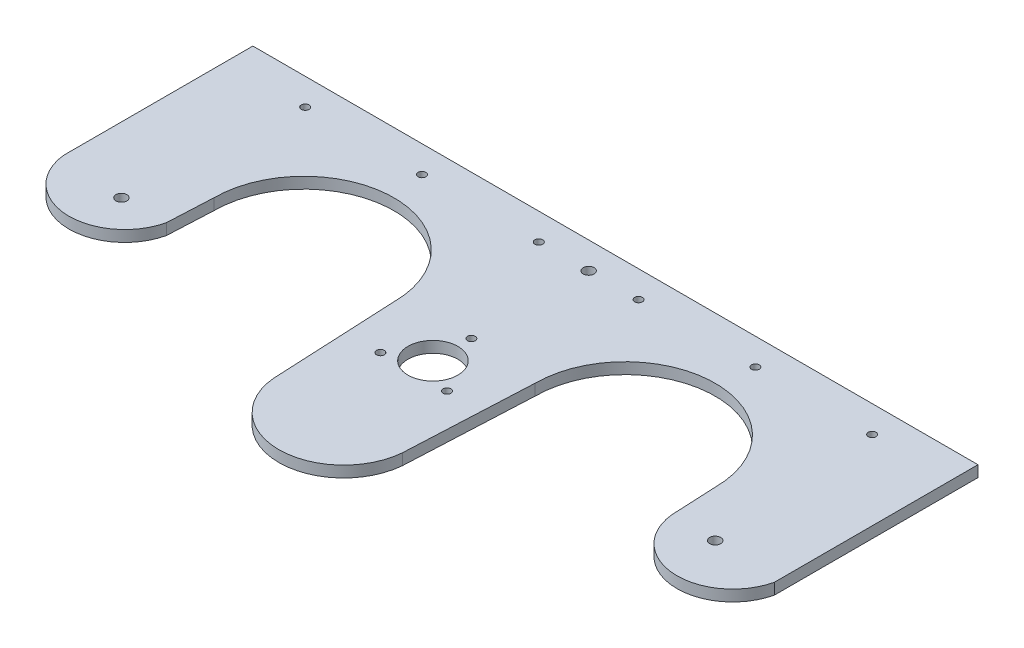
ISO-10303-21;
HEADER;
FILE_DESCRIPTION(('STEP AP214'),'2;1');
FILE_NAME('part.step','',(''),(''),'','','');
FILE_SCHEMA(('AUTOMOTIVE_DESIGN { 1 0 10303 214 1 1 1 1 }'));
ENDSEC;
DATA;
#1=APPLICATION_CONTEXT('core data for automotive mechanical design processes');
#2=APPLICATION_PROTOCOL_DEFINITION('international standard','automotive_design',2000,#1);
#3=PRODUCT_CONTEXT('',#1,'mechanical');
#4=PRODUCT('Part','Part','',(#3));
#5=PRODUCT_RELATED_PRODUCT_CATEGORY('part','',(#4));
#6=PRODUCT_DEFINITION_FORMATION('','',#4);
#7=PRODUCT_DEFINITION_CONTEXT('part definition',#1,'design');
#8=PRODUCT_DEFINITION('design','',#6,#7);
#9=PRODUCT_DEFINITION_SHAPE('','',#8);
#10=(LENGTH_UNIT() NAMED_UNIT(*) SI_UNIT(.MILLI.,.METRE.));
#11=(NAMED_UNIT(*) PLANE_ANGLE_UNIT() SI_UNIT($,.RADIAN.));
#12=(NAMED_UNIT(*) SI_UNIT($,.STERADIAN.) SOLID_ANGLE_UNIT());
#13=UNCERTAINTY_MEASURE_WITH_UNIT(LENGTH_MEASURE(1.E-05),#10,'distance_accuracy_value','');
#14=(GEOMETRIC_REPRESENTATION_CONTEXT(3) GLOBAL_UNCERTAINTY_ASSIGNED_CONTEXT((#13)) GLOBAL_UNIT_ASSIGNED_CONTEXT((#10,
#11,#12)) REPRESENTATION_CONTEXT('',''));
#15=CARTESIAN_POINT('',(0.,0.,0.));
#16=DIRECTION('',(0.,0.,1.));
#17=DIRECTION('',(1.,0.,0.));
#18=AXIS2_PLACEMENT_3D('',#15,#16,#17);
#19=CARTESIAN_POINT('',(0.,4.6,0.));
#20=DIRECTION('',(1.,0.,0.));
#21=DIRECTION('',(0.,0.,-1.));
#22=AXIS2_PLACEMENT_3D('',#19,#20,#21);
#23=PLANE('',#22);
#24=DIRECTION('',(0.,0.,1.));
#25=VECTOR('',#24,1.);
#26=CARTESIAN_POINT('',(0.,0.,0.));
#27=LINE('',#26,#25);
#28=CARTESIAN_POINT('',(0.,0.,-145.));
#29=VERTEX_POINT('',#28);
#30=CARTESIAN_POINT('',(0.,0.,-67.3853154496635));
#31=VERTEX_POINT('',#30);
#32=EDGE_CURVE('E165',#29,#31,#27,.T.);
#33=ORIENTED_EDGE('',*,*,#32,.T.);
#34=DIRECTION('',(0.,1.,0.));
#35=VECTOR('',#34,1.);
#36=CARTESIAN_POINT('',(0.,0.,-67.3853154496635));
#37=LINE('',#36,#35);
#38=CARTESIAN_POINT('',(0.,4.6,-67.3853154496635));
#39=VERTEX_POINT('',#38);
#40=EDGE_CURVE('E206',#31,#39,#37,.T.);
#41=ORIENTED_EDGE('',*,*,#40,.T.);
#42=DIRECTION('',(0.,0.,1.));
#43=VECTOR('',#42,1.);
#44=CARTESIAN_POINT('',(0.,4.6,0.));
#45=LINE('',#44,#43);
#46=CARTESIAN_POINT('',(0.,4.6,-145.));
#47=VERTEX_POINT('',#46);
#48=EDGE_CURVE('E138',#47,#39,#45,.T.);
#49=ORIENTED_EDGE('',*,*,#48,.F.);
#50=DIRECTION('',(0.,-1.,0.));
#51=VECTOR('',#50,1.);
#52=CARTESIAN_POINT('',(0.,4.6,-145.));
#53=LINE('',#52,#51);
#54=EDGE_CURVE('E164',#47,#29,#53,.T.);
#55=ORIENTED_EDGE('',*,*,#54,.T.);
#56=EDGE_LOOP('',(#33,#41,#49,#55));
#57=FACE_BOUND('',#56,.T.);
#58=ADVANCED_FACE('F33',(#57),#23,.F.);
#59=CARTESIAN_POINT('',(298.,4.6,0.));
#60=DIRECTION('',(-1.,0.,0.));
#61=DIRECTION('',(0.,0.,1.));
#62=AXIS2_PLACEMENT_3D('',#59,#60,#61);
#63=PLANE('',#62);
#64=DIRECTION('',(0.,-1.,0.));
#65=VECTOR('',#64,1.);
#66=CARTESIAN_POINT('',(298.,4.6,-145.));
#67=LINE('',#66,#65);
#68=CARTESIAN_POINT('',(298.,4.6,-145.));
#69=VERTEX_POINT('',#68);
#70=CARTESIAN_POINT('',(298.,0.,-145.));
#71=VERTEX_POINT('',#70);
#72=EDGE_CURVE('E173',#69,#71,#67,.T.);
#73=ORIENTED_EDGE('',*,*,#72,.F.);
#74=DIRECTION('',(0.,0.,-1.));
#75=VECTOR('',#74,1.);
#76=CARTESIAN_POINT('',(298.,4.6,0.));
#77=LINE('',#76,#75);
#78=CARTESIAN_POINT('',(298.,4.6,-61.3235794151352));
#79=VERTEX_POINT('',#78);
#80=EDGE_CURVE('E159',#79,#69,#77,.T.);
#81=ORIENTED_EDGE('',*,*,#80,.F.);
#82=DIRECTION('',(0.,1.,0.));
#83=VECTOR('',#82,1.);
#84=CARTESIAN_POINT('',(298.,0.,-61.3235794151352));
#85=LINE('',#84,#83);
#86=CARTESIAN_POINT('',(298.,0.,-61.3235794151352));
#87=VERTEX_POINT('',#86);
#88=EDGE_CURVE('E129',#79,#87,#85,.F.);
#89=ORIENTED_EDGE('',*,*,#88,.T.);
#90=DIRECTION('',(0.,0.,-1.));
#91=VECTOR('',#90,1.);
#92=CARTESIAN_POINT('',(298.,0.,0.));
#93=LINE('',#92,#91);
#94=EDGE_CURVE('E167',#87,#71,#93,.T.);
#95=ORIENTED_EDGE('',*,*,#94,.T.);
#96=EDGE_LOOP('',(#73,#81,#89,#95));
#97=FACE_BOUND('',#96,.T.);
#98=ADVANCED_FACE('F310',(#97),#63,.F.);
#99=CARTESIAN_POINT('',(0.,4.6,-145.));
#100=DIRECTION('',(0.,0.,1.));
#101=DIRECTION('',(1.,0.,0.));
#102=AXIS2_PLACEMENT_3D('',#99,#100,#101);
#103=PLANE('',#102);
#104=DIRECTION('',(-1.,0.,0.));
#105=VECTOR('',#104,1.);
#106=CARTESIAN_POINT('',(0.,0.,-145.));
#107=LINE('',#106,#105);
#108=EDGE_CURVE('E160',#71,#29,#107,.T.);
#109=ORIENTED_EDGE('',*,*,#108,.T.);
#110=ORIENTED_EDGE('',*,*,#54,.F.);
#111=DIRECTION('',(-1.,0.,0.));
#112=VECTOR('',#111,1.);
#113=CARTESIAN_POINT('',(0.,4.6,-145.));
#114=LINE('',#113,#112);
#115=EDGE_CURVE('E162',#69,#47,#114,.T.);
#116=ORIENTED_EDGE('',*,*,#115,.F.);
#117=ORIENTED_EDGE('',*,*,#72,.T.);
#118=EDGE_LOOP('',(#109,#110,#116,#117));
#119=FACE_BOUND('',#118,.T.);
#120=ADVANCED_FACE('F315',(#119),#103,.F.);
#121=CARTESIAN_POINT('',(0.,4.6,0.));
#122=DIRECTION('',(0.,-1.,0.));
#123=DIRECTION('',(0.,0.,-1.));
#124=AXIS2_PLACEMENT_3D('',#121,#122,#123);
#125=PLANE('',#124);
#126=CARTESIAN_POINT('',(27.,4.6,-64.));
#127=DIRECTION('',(0.,1.,0.));
#128=DIRECTION('',(0.,0.,1.));
#129=AXIS2_PLACEMENT_3D('',#126,#127,#128);
#130=CIRCLE('',#129,2.25);
#131=CARTESIAN_POINT('',(27.,4.6,-61.75));
#132=VERTEX_POINT('',#131);
#133=EDGE_CURVE('E191',#132,#132,#130,.T.);
#134=ORIENTED_EDGE('',*,*,#133,.F.);
#135=EDGE_LOOP('',(#134));
#136=FACE_BOUND('',#135,.T.);
#137=CARTESIAN_POINT('',(149.,4.6,-134.));
#138=DIRECTION('',(0.,1.,0.));
#139=DIRECTION('',(0.,0.,1.));
#140=AXIS2_PLACEMENT_3D('',#137,#138,#139);
#141=CIRCLE('',#140,2.25000000000001);
#142=CARTESIAN_POINT('',(149.,4.6,-131.75));
#143=VERTEX_POINT('',#142);
#144=EDGE_CURVE('E324',#143,#143,#141,.T.);
#145=ORIENTED_EDGE('',*,*,#144,.F.);
#146=EDGE_LOOP('',(#145));
#147=FACE_BOUND('',#146,.T.);
#148=CARTESIAN_POINT('',(271.,4.6,-64.));
#149=DIRECTION('',(0.,1.,0.));
#150=DIRECTION('',(0.,0.,1.));
#151=AXIS2_PLACEMENT_3D('',#148,#149,#150);
#152=CIRCLE('',#151,2.24999999999995);
#153=CARTESIAN_POINT('',(271.,4.6,-61.75));
#154=VERTEX_POINT('',#153);
#155=EDGE_CURVE('E321',#154,#154,#152,.T.);
#156=ORIENTED_EDGE('',*,*,#155,.F.);
#157=EDGE_LOOP('',(#156));
#158=FACE_BOUND('',#157,.T.);
#159=ORIENTED_EDGE('',*,*,#48,.T.);
#160=CARTESIAN_POINT('',(22.7977861678741,4.6,-69.5465525592583));
#161=DIRECTION('',(0.,-1.,0.));
#162=DIRECTION('',(0.,0.,-1.));
#163=AXIS2_PLACEMENT_3D('',#160,#161,#162);
#164=CIRCLE('',#163,22.9);
#165=CARTESIAN_POINT('',(45.1014191533686,4.6,-64.3544474323988));
#166=VERTEX_POINT('',#165);
#167=EDGE_CURVE('E124',#166,#39,#164,.T.);
#168=ORIENTED_EDGE('',*,*,#167,.F.);
#169=DIRECTION('',(-0.048136903485688,0.,0.998840747328026));
#170=VECTOR('',#169,1.);
#171=CARTESIAN_POINT('',(46.,4.6,-83.));
#172=LINE('',#171,#170);
#173=CARTESIAN_POINT('',(46.,4.6,-83.));
#174=VERTEX_POINT('',#173);
#175=EDGE_CURVE('E136',#174,#166,#172,.T.);
#176=ORIENTED_EDGE('',*,*,#175,.F.);
#177=CARTESIAN_POINT('',(83.,4.6,-83.));
#178=DIRECTION('',(0.,1.,0.));
#179=DIRECTION('',(0.,0.,-1.));
#180=AXIS2_PLACEMENT_3D('',#177,#178,#179);
#181=CIRCLE('',#180,37.);
#182=CARTESIAN_POINT('',(120.,4.6,-83.));
#183=VERTEX_POINT('',#182);
#184=EDGE_CURVE('E146',#183,#174,#181,.T.);
#185=ORIENTED_EDGE('',*,*,#184,.F.);
#186=DIRECTION('',(-0.048136903485688,0.,-0.998840747328026));
#187=VECTOR('',#186,1.);
#188=CARTESIAN_POINT('',(120.,4.6,-83.));
#189=LINE('',#188,#187);
#190=CARTESIAN_POINT('',(122.506024096386,4.6,-30.9999999999999));
#191=VERTEX_POINT('',#190);
#192=EDGE_CURVE('E145',#191,#183,#189,.T.);
#193=ORIENTED_EDGE('',*,*,#192,.F.);
#194=CARTESIAN_POINT('',(149.,4.6,-33.2867412736775));
#195=DIRECTION('',(0.,-1.,0.));
#196=DIRECTION('',(0.,0.,1.));
#197=AXIS2_PLACEMENT_3D('',#194,#195,#196);
#198=CIRCLE('',#197,26.5924791028223);
#199=CARTESIAN_POINT('',(175.493975903614,4.6,-30.9999999999999));
#200=VERTEX_POINT('',#199);
#201=EDGE_CURVE('E208',#200,#191,#198,.T.);
#202=ORIENTED_EDGE('',*,*,#201,.F.);
#203=DIRECTION('',(-0.048136903485688,0.,0.998840747328026));
#204=VECTOR('',#203,1.);
#205=CARTESIAN_POINT('',(178.,4.6,-83.));
#206=LINE('',#205,#204);
#207=CARTESIAN_POINT('',(178.,4.6,-83.));
#208=VERTEX_POINT('',#207);
#209=EDGE_CURVE('E156',#208,#200,#206,.T.);
#210=ORIENTED_EDGE('',*,*,#209,.F.);
#211=CARTESIAN_POINT('',(215.,4.6,-83.));
#212=DIRECTION('',(0.,1.,0.));
#213=DIRECTION('',(0.,0.,1.));
#214=AXIS2_PLACEMENT_3D('',#211,#212,#213);
#215=CIRCLE('',#214,37.);
#216=CARTESIAN_POINT('',(252.,4.6,-83.));
#217=VERTEX_POINT('',#216);
#218=EDGE_CURVE('E281',#217,#208,#215,.T.);
#219=ORIENTED_EDGE('',*,*,#218,.F.);
#220=DIRECTION('',(-0.048136903485688,0.,-0.998840747328026));
#221=VECTOR('',#220,1.);
#222=CARTESIAN_POINT('',(252.,4.6,-83.));
#223=LINE('',#222,#221);
#224=CARTESIAN_POINT('',(252.898580846631,4.6,-64.3544474323986));
#225=VERTEX_POINT('',#224);
#226=EDGE_CURVE('E279',#225,#217,#223,.T.);
#227=ORIENTED_EDGE('',*,*,#226,.F.);
#228=CARTESIAN_POINT('',(275.696367014505,4.6,-66.515684541994));
#229=DIRECTION('',(0.,-1.,0.));
#230=DIRECTION('',(0.,0.,-1.));
#231=AXIS2_PLACEMENT_3D('',#228,#229,#230);
#232=CIRCLE('',#231,22.9);
#233=EDGE_CURVE('E57',#79,#225,#232,.T.);
#234=ORIENTED_EDGE('',*,*,#233,.F.);
#235=ORIENTED_EDGE('',*,*,#80,.T.);
#236=ORIENTED_EDGE('',*,*,#115,.T.);
#237=EDGE_LOOP('',(#159,#168,#176,#185,#193,#202,#210,#219,#227,#234,#235,#236));
#238=FACE_BOUND('',#237,.T.);
#239=CARTESIAN_POINT('',(149.,4.6,-70.));
#240=DIRECTION('',(0.,1.,0.));
#241=DIRECTION('',(0.,0.,1.));
#242=AXIS2_PLACEMENT_3D('',#239,#240,#241);
#243=CIRCLE('',#242,10.25);
#244=CARTESIAN_POINT('',(149.,4.6,-59.75));
#245=VERTEX_POINT('',#244);
#246=EDGE_CURVE('E240',#245,#245,#243,.T.);
#247=ORIENTED_EDGE('',*,*,#246,.F.);
#248=EDGE_LOOP('',(#247));
#249=FACE_BOUND('',#248,.T.);
#250=CARTESIAN_POINT('',(265.5,4.6,-134.));
#251=DIRECTION('',(0.,1.,0.));
#252=DIRECTION('',(0.,0.,-1.));
#253=AXIS2_PLACEMENT_3D('',#250,#251,#252);
#254=CIRCLE('',#253,1.59999999999996);
#255=CARTESIAN_POINT('',(265.5,4.6,-135.6));
#256=VERTEX_POINT('',#255);
#257=EDGE_CURVE('E222',#256,#256,#254,.T.);
#258=ORIENTED_EDGE('',*,*,#257,.F.);
#259=EDGE_LOOP('',(#258));
#260=FACE_BOUND('',#259,.T.);
#261=CARTESIAN_POINT('',(169.5,4.6,-134.));
#262=DIRECTION('',(0.,1.,0.));
#263=DIRECTION('',(0.,0.,-1.));
#264=AXIS2_PLACEMENT_3D('',#261,#262,#263);
#265=CIRCLE('',#264,1.59999999999999);
#266=CARTESIAN_POINT('',(169.5,4.6,-135.6));
#267=VERTEX_POINT('',#266);
#268=EDGE_CURVE('E265',#267,#267,#265,.T.);
#269=ORIENTED_EDGE('',*,*,#268,.F.);
#270=EDGE_LOOP('',(#269));
#271=FACE_BOUND('',#270,.T.);
#272=CARTESIAN_POINT('',(217.5,4.6,-134.));
#273=DIRECTION('',(0.,1.,0.));
#274=DIRECTION('',(0.,0.,-1.));
#275=AXIS2_PLACEMENT_3D('',#272,#273,#274);
#276=CIRCLE('',#275,1.60000000000002);
#277=CARTESIAN_POINT('',(217.5,4.6,-135.6));
#278=VERTEX_POINT('',#277);
#279=EDGE_CURVE('E259',#278,#278,#276,.T.);
#280=ORIENTED_EDGE('',*,*,#279,.F.);
#281=EDGE_LOOP('',(#280));
#282=FACE_BOUND('',#281,.T.);
#283=CARTESIAN_POINT('',(128.5,4.6,-134.));
#284=DIRECTION('',(0.,1.,0.));
#285=DIRECTION('',(0.,0.,1.));
#286=AXIS2_PLACEMENT_3D('',#283,#284,#285);
#287=CIRCLE('',#286,1.59999999999999);
#288=CARTESIAN_POINT('',(128.5,4.6,-132.4));
#289=VERTEX_POINT('',#288);
#290=EDGE_CURVE('E253',#289,#289,#287,.T.);
#291=ORIENTED_EDGE('',*,*,#290,.F.);
#292=EDGE_LOOP('',(#291));
#293=FACE_BOUND('',#292,.T.);
#294=CARTESIAN_POINT('',(80.5,4.6,-134.));
#295=DIRECTION('',(0.,1.,0.));
#296=DIRECTION('',(0.,0.,1.));
#297=AXIS2_PLACEMENT_3D('',#294,#295,#296);
#298=CIRCLE('',#297,1.6);
#299=CARTESIAN_POINT('',(80.5,4.6,-132.4));
#300=VERTEX_POINT('',#299);
#301=EDGE_CURVE('E247',#300,#300,#298,.T.);
#302=ORIENTED_EDGE('',*,*,#301,.F.);
#303=EDGE_LOOP('',(#302));
#304=FACE_BOUND('',#303,.T.);
#305=CARTESIAN_POINT('',(32.5,4.6,-134.));
#306=DIRECTION('',(0.,1.,0.));
#307=DIRECTION('',(0.,0.,1.));
#308=AXIS2_PLACEMENT_3D('',#305,#306,#307);
#309=CIRCLE('',#308,1.6);
#310=CARTESIAN_POINT('',(32.5,4.6,-132.4));
#311=VERTEX_POINT('',#310);
#312=EDGE_CURVE('E241',#311,#311,#309,.T.);
#313=ORIENTED_EDGE('',*,*,#312,.F.);
#314=EDGE_LOOP('',(#313));
#315=FACE_BOUND('',#314,.T.);
#316=CARTESIAN_POINT('',(162.691861633832,4.6,-62.095));
#317=DIRECTION('',(0.,1.,0.));
#318=DIRECTION('',(0.,0.,1.));
#319=AXIS2_PLACEMENT_3D('',#316,#317,#318);
#320=CIRCLE('',#319,1.59999999999999);
#321=CARTESIAN_POINT('',(162.691861633832,4.6,-60.495));
#322=VERTEX_POINT('',#321);
#323=EDGE_CURVE('E216',#322,#322,#320,.T.);
#324=ORIENTED_EDGE('',*,*,#323,.F.);
#325=EDGE_LOOP('',(#324));
#326=FACE_BOUND('',#325,.T.);
#327=CARTESIAN_POINT('',(135.308138366168,4.6,-62.095));
#328=DIRECTION('',(0.,1.,0.));
#329=DIRECTION('',(0.,0.,1.));
#330=AXIS2_PLACEMENT_3D('',#327,#328,#329);
#331=CIRCLE('',#330,1.59999999999999);
#332=CARTESIAN_POINT('',(135.308138366168,4.6,-60.495));
#333=VERTEX_POINT('',#332);
#334=EDGE_CURVE('E229',#333,#333,#331,.T.);
#335=ORIENTED_EDGE('',*,*,#334,.F.);
#336=EDGE_LOOP('',(#335));
#337=FACE_BOUND('',#336,.T.);
#338=CARTESIAN_POINT('',(149.,4.6,-85.81));
#339=DIRECTION('',(0.,1.,0.));
#340=DIRECTION('',(0.,0.,1.));
#341=AXIS2_PLACEMENT_3D('',#338,#339,#340);
#342=CIRCLE('',#341,1.59999999999999);
#343=CARTESIAN_POINT('',(149.,4.6,-84.21));
#344=VERTEX_POINT('',#343);
#345=EDGE_CURVE('E223',#344,#344,#342,.T.);
#346=ORIENTED_EDGE('',*,*,#345,.F.);
#347=EDGE_LOOP('',(#346));
#348=FACE_BOUND('',#347,.T.);
#349=ADVANCED_FACE('F133',(#136,#147,#158,#238,#249,#260,#271,#282,#293,#304,#315,#326,#337,
#348),#125,.F.);
#350=CARTESIAN_POINT('',(0.,0.,0.));
#351=DIRECTION('',(0.,-1.,0.));
#352=DIRECTION('',(0.,0.,-1.));
#353=AXIS2_PLACEMENT_3D('',#350,#351,#352);
#354=PLANE('',#353);
#355=CARTESIAN_POINT('',(27.,0.,-64.));
#356=DIRECTION('',(0.,-1.,0.));
#357=DIRECTION('',(0.,0.,-1.));
#358=AXIS2_PLACEMENT_3D('',#355,#356,#357);
#359=CIRCLE('',#358,2.25);
#360=CARTESIAN_POINT('',(27.,0.,-66.25));
#361=VERTEX_POINT('',#360);
#362=EDGE_CURVE('E36',#361,#361,#359,.T.);
#363=ORIENTED_EDGE('',*,*,#362,.F.);
#364=EDGE_LOOP('',(#363));
#365=FACE_BOUND('',#364,.T.);
#366=CARTESIAN_POINT('',(149.,0.,-134.));
#367=DIRECTION('',(0.,-1.,0.));
#368=DIRECTION('',(0.,0.,-1.));
#369=AXIS2_PLACEMENT_3D('',#366,#367,#368);
#370=CIRCLE('',#369,2.25000000000001);
#371=CARTESIAN_POINT('',(149.,0.,-136.25));
#372=VERTEX_POINT('',#371);
#373=EDGE_CURVE('E190',#372,#372,#370,.T.);
#374=ORIENTED_EDGE('',*,*,#373,.F.);
#375=EDGE_LOOP('',(#374));
#376=FACE_BOUND('',#375,.T.);
#377=CARTESIAN_POINT('',(271.,0.,-64.));
#378=DIRECTION('',(0.,-1.,0.));
#379=DIRECTION('',(0.,0.,-1.));
#380=AXIS2_PLACEMENT_3D('',#377,#378,#379);
#381=CIRCLE('',#380,2.24999999999995);
#382=CARTESIAN_POINT('',(271.,0.,-66.2499999999999));
#383=VERTEX_POINT('',#382);
#384=EDGE_CURVE('E188',#383,#383,#381,.T.);
#385=ORIENTED_EDGE('',*,*,#384,.F.);
#386=EDGE_LOOP('',(#385));
#387=FACE_BOUND('',#386,.T.);
#388=CARTESIAN_POINT('',(22.7977861678741,0.,-69.5465525592583));
#389=DIRECTION('',(0.,-1.,0.));
#390=DIRECTION('',(0.,0.,-1.));
#391=AXIS2_PLACEMENT_3D('',#388,#389,#390);
#392=CIRCLE('',#391,22.9);
#393=CARTESIAN_POINT('',(45.1014191533686,0.,-64.3544474323976));
#394=VERTEX_POINT('',#393);
#395=EDGE_CURVE('E49',#394,#31,#392,.T.);
#396=ORIENTED_EDGE('',*,*,#395,.T.);
#397=ORIENTED_EDGE('',*,*,#32,.F.);
#398=ORIENTED_EDGE('',*,*,#108,.F.);
#399=ORIENTED_EDGE('',*,*,#94,.F.);
#400=CARTESIAN_POINT('',(275.696367014505,0.,-66.515684541994));
#401=DIRECTION('',(0.,-1.,0.));
#402=DIRECTION('',(0.,0.,-1.));
#403=AXIS2_PLACEMENT_3D('',#400,#401,#402);
#404=CIRCLE('',#403,22.9);
#405=CARTESIAN_POINT('',(252.898580846631,0.,-64.3544474323988));
#406=VERTEX_POINT('',#405);
#407=EDGE_CURVE('E198',#87,#406,#404,.T.);
#408=ORIENTED_EDGE('',*,*,#407,.T.);
#409=DIRECTION('',(0.048136903485688,0.,0.998840747328026));
#410=VECTOR('',#409,1.);
#411=CARTESIAN_POINT('',(255.406806661839,0.,-12.3087617668356));
#412=LINE('',#411,#410);
#413=CARTESIAN_POINT('',(252.,0.,-83.));
#414=VERTEX_POINT('',#413);
#415=EDGE_CURVE('E183',#414,#406,#412,.T.);
#416=ORIENTED_EDGE('',*,*,#415,.F.);
#417=CARTESIAN_POINT('',(215.,0.,-83.));
#418=DIRECTION('',(0.,-1.,0.));
#419=DIRECTION('',(0.,0.,-1.));
#420=AXIS2_PLACEMENT_3D('',#417,#418,#419);
#421=CIRCLE('',#420,37.);
#422=CARTESIAN_POINT('',(178.,0.,-83.));
#423=VERTEX_POINT('',#422);
#424=EDGE_CURVE('E41',#423,#414,#421,.T.);
#425=ORIENTED_EDGE('',*,*,#424,.F.);
#426=DIRECTION('',(0.048136903485688,0.,-0.998840747328026));
#427=VECTOR('',#426,1.);
#428=CARTESIAN_POINT('',(173.596813902969,0.,8.3661115133961));
#429=LINE('',#428,#427);
#430=CARTESIAN_POINT('',(175.493975903614,0.,-30.9999999999999));
#431=VERTEX_POINT('',#430);
#432=EDGE_CURVE('E11',#431,#423,#429,.T.);
#433=ORIENTED_EDGE('',*,*,#432,.F.);
#434=CARTESIAN_POINT('',(149.,0.,-33.2867412736775));
#435=DIRECTION('',(0.,-1.,0.));
#436=DIRECTION('',(0.,0.,1.));
#437=AXIS2_PLACEMENT_3D('',#434,#435,#436);
#438=CIRCLE('',#437,26.5924791028223);
#439=CARTESIAN_POINT('',(122.506024096386,0.,-30.9999999999999));
#440=VERTEX_POINT('',#439);
#441=EDGE_CURVE('E209',#431,#440,#438,.T.);
#442=ORIENTED_EDGE('',*,*,#441,.T.);
#443=DIRECTION('',(0.048136903485688,0.,0.998840747328026));
#444=VECTOR('',#443,1.);
#445=CARTESIAN_POINT('',(123.712671976828,0.,-5.96205648081101));
#446=LINE('',#445,#444);
#447=CARTESIAN_POINT('',(120.,0.,-83.));
#448=VERTEX_POINT('',#447);
#449=EDGE_CURVE('E180',#448,#440,#446,.T.);
#450=ORIENTED_EDGE('',*,*,#449,.F.);
#451=CARTESIAN_POINT('',(83.,0.,-83.));
#452=DIRECTION('',(0.,-1.,0.));
#453=DIRECTION('',(0.,0.,-1.));
#454=AXIS2_PLACEMENT_3D('',#451,#452,#453);
#455=CIRCLE('',#454,37.);
#456=CARTESIAN_POINT('',(46.,0.,-83.));
#457=VERTEX_POINT('',#456);
#458=EDGE_CURVE('E178',#457,#448,#455,.T.);
#459=ORIENTED_EDGE('',*,*,#458,.F.);
#460=DIRECTION('',(0.048136903485688,0.,-0.998840747328026));
#461=VECTOR('',#460,1.);
#462=CARTESIAN_POINT('',(41.902679217958,0.,2.01940622737147));
#463=LINE('',#462,#461);
#464=EDGE_CURVE('E176',#394,#457,#463,.T.);
#465=ORIENTED_EDGE('',*,*,#464,.F.);
#466=EDGE_LOOP('',(#396,#397,#398,#399,#408,#416,#425,#433,#442,#450,#459,#465));
#467=FACE_BOUND('',#466,.T.);
#468=CARTESIAN_POINT('',(149.,0.,-85.81));
#469=DIRECTION('',(0.,1.,0.));
#470=DIRECTION('',(0.,0.,1.));
#471=AXIS2_PLACEMENT_3D('',#468,#469,#470);
#472=CIRCLE('',#471,1.59999999999999);
#473=CARTESIAN_POINT('',(149.,0.,-84.21));
#474=VERTEX_POINT('',#473);
#475=EDGE_CURVE('E219',#474,#474,#472,.T.);
#476=ORIENTED_EDGE('',*,*,#475,.T.);
#477=EDGE_LOOP('',(#476));
#478=FACE_BOUND('',#477,.T.);
#479=CARTESIAN_POINT('',(135.308138366168,0.,-62.095));
#480=DIRECTION('',(0.,1.,0.));
#481=DIRECTION('',(0.,0.,1.));
#482=AXIS2_PLACEMENT_3D('',#479,#480,#481);
#483=CIRCLE('',#482,1.59999999999999);
#484=CARTESIAN_POINT('',(135.308138366168,0.,-60.495));
#485=VERTEX_POINT('',#484);
#486=EDGE_CURVE('E226',#485,#485,#483,.T.);
#487=ORIENTED_EDGE('',*,*,#486,.T.);
#488=EDGE_LOOP('',(#487));
#489=FACE_BOUND('',#488,.T.);
#490=CARTESIAN_POINT('',(162.691861633832,0.,-62.095));
#491=DIRECTION('',(0.,1.,0.));
#492=DIRECTION('',(0.,0.,1.));
#493=AXIS2_PLACEMENT_3D('',#490,#491,#492);
#494=CIRCLE('',#493,1.59999999999999);
#495=CARTESIAN_POINT('',(162.691861633832,0.,-60.495));
#496=VERTEX_POINT('',#495);
#497=EDGE_CURVE('E232',#496,#496,#494,.T.);
#498=ORIENTED_EDGE('',*,*,#497,.T.);
#499=EDGE_LOOP('',(#498));
#500=FACE_BOUND('',#499,.T.);
#501=CARTESIAN_POINT('',(32.5,0.,-134.));
#502=DIRECTION('',(0.,1.,0.));
#503=DIRECTION('',(0.,0.,1.));
#504=AXIS2_PLACEMENT_3D('',#501,#502,#503);
#505=CIRCLE('',#504,1.6);
#506=CARTESIAN_POINT('',(32.5,0.,-132.4));
#507=VERTEX_POINT('',#506);
#508=EDGE_CURVE('E237',#507,#507,#505,.T.);
#509=ORIENTED_EDGE('',*,*,#508,.T.);
#510=EDGE_LOOP('',(#509));
#511=FACE_BOUND('',#510,.T.);
#512=CARTESIAN_POINT('',(80.5,0.,-134.));
#513=DIRECTION('',(0.,1.,0.));
#514=DIRECTION('',(0.,0.,1.));
#515=AXIS2_PLACEMENT_3D('',#512,#513,#514);
#516=CIRCLE('',#515,1.6);
#517=CARTESIAN_POINT('',(80.5,0.,-132.4));
#518=VERTEX_POINT('',#517);
#519=EDGE_CURVE('E244',#518,#518,#516,.T.);
#520=ORIENTED_EDGE('',*,*,#519,.T.);
#521=EDGE_LOOP('',(#520));
#522=FACE_BOUND('',#521,.T.);
#523=CARTESIAN_POINT('',(128.5,0.,-134.));
#524=DIRECTION('',(0.,1.,0.));
#525=DIRECTION('',(0.,0.,1.));
#526=AXIS2_PLACEMENT_3D('',#523,#524,#525);
#527=CIRCLE('',#526,1.59999999999999);
#528=CARTESIAN_POINT('',(128.5,0.,-132.4));
#529=VERTEX_POINT('',#528);
#530=EDGE_CURVE('E250',#529,#529,#527,.T.);
#531=ORIENTED_EDGE('',*,*,#530,.T.);
#532=EDGE_LOOP('',(#531));
#533=FACE_BOUND('',#532,.T.);
#534=CARTESIAN_POINT('',(217.5,0.,-134.));
#535=DIRECTION('',(0.,1.,0.));
#536=DIRECTION('',(0.,0.,-1.));
#537=AXIS2_PLACEMENT_3D('',#534,#535,#536);
#538=CIRCLE('',#537,1.60000000000002);
#539=CARTESIAN_POINT('',(217.5,0.,-135.6));
#540=VERTEX_POINT('',#539);
#541=EDGE_CURVE('E256',#540,#540,#538,.T.);
#542=ORIENTED_EDGE('',*,*,#541,.T.);
#543=EDGE_LOOP('',(#542));
#544=FACE_BOUND('',#543,.T.);
#545=CARTESIAN_POINT('',(169.5,0.,-134.));
#546=DIRECTION('',(0.,1.,0.));
#547=DIRECTION('',(0.,0.,-1.));
#548=AXIS2_PLACEMENT_3D('',#545,#546,#547);
#549=CIRCLE('',#548,1.59999999999999);
#550=CARTESIAN_POINT('',(169.5,0.,-135.6));
#551=VERTEX_POINT('',#550);
#552=EDGE_CURVE('E262',#551,#551,#549,.T.);
#553=ORIENTED_EDGE('',*,*,#552,.T.);
#554=EDGE_LOOP('',(#553));
#555=FACE_BOUND('',#554,.T.);
#556=CARTESIAN_POINT('',(265.5,0.,-134.));
#557=DIRECTION('',(0.,1.,0.));
#558=DIRECTION('',(0.,0.,-1.));
#559=AXIS2_PLACEMENT_3D('',#556,#557,#558);
#560=CIRCLE('',#559,1.59999999999996);
#561=CARTESIAN_POINT('',(265.5,0.,-135.6));
#562=VERTEX_POINT('',#561);
#563=EDGE_CURVE('E268',#562,#562,#560,.T.);
#564=ORIENTED_EDGE('',*,*,#563,.T.);
#565=EDGE_LOOP('',(#564));
#566=FACE_BOUND('',#565,.T.);
#567=CARTESIAN_POINT('',(149.,0.,-70.));
#568=DIRECTION('',(0.,1.,0.));
#569=DIRECTION('',(0.,0.,1.));
#570=AXIS2_PLACEMENT_3D('',#567,#568,#569);
#571=CIRCLE('',#570,10.25);
#572=CARTESIAN_POINT('',(149.,0.,-59.75));
#573=VERTEX_POINT('',#572);
#574=EDGE_CURVE('E149',#573,#573,#571,.T.);
#575=ORIENTED_EDGE('',*,*,#574,.T.);
#576=EDGE_LOOP('',(#575));
#577=FACE_BOUND('',#576,.T.);
#578=ADVANCED_FACE('F302',(#365,#376,#387,#467,#478,#489,#500,#511,#522,#533,#544,#555,#566,
#577),#354,.T.);
#579=CARTESIAN_POINT('',(83.,-42.,-83.));
#580=DIRECTION('',(0.,1.,0.));
#581=DIRECTION('',(0.,0.,1.));
#582=AXIS2_PLACEMENT_3D('',#579,#580,#581);
#583=CYLINDRICAL_SURFACE('',#582,37.);
#584=ORIENTED_EDGE('',*,*,#458,.T.);
#585=DIRECTION('',(0.,1.,0.));
#586=VECTOR('',#585,1.);
#587=CARTESIAN_POINT('',(120.,-42.,-83.));
#588=LINE('',#587,#586);
#589=EDGE_CURVE('E153',#448,#183,#588,.T.);
#590=ORIENTED_EDGE('',*,*,#589,.T.);
#591=ORIENTED_EDGE('',*,*,#184,.T.);
#592=DIRECTION('',(0.,1.,0.));
#593=VECTOR('',#592,1.);
#594=CARTESIAN_POINT('',(46.,-42.,-83.));
#595=LINE('',#594,#593);
#596=EDGE_CURVE('E143',#457,#174,#595,.T.);
#597=ORIENTED_EDGE('',*,*,#596,.F.);
#598=EDGE_LOOP('',(#584,#590,#591,#597));
#599=FACE_BOUND('',#598,.T.);
#600=ADVANCED_FACE('F360',(#599),#583,.F.);
#601=CARTESIAN_POINT('',(120.,-42.,-83.));
#602=DIRECTION('',(0.998840747328026,0.,-0.048136903485688));
#603=DIRECTION('',(-0.048136903485688,0.,-0.998840747328026));
#604=AXIS2_PLACEMENT_3D('',#601,#602,#603);
#605=PLANE('',#604);
#606=ORIENTED_EDGE('',*,*,#449,.T.);
#607=DIRECTION('',(0.,1.,0.));
#608=VECTOR('',#607,1.);
#609=CARTESIAN_POINT('',(122.506024096386,0.,-30.9999999999999));
#610=LINE('',#609,#608);
#611=EDGE_CURVE('E212',#440,#191,#610,.T.);
#612=ORIENTED_EDGE('',*,*,#611,.T.);
#613=ORIENTED_EDGE('',*,*,#192,.T.);
#614=ORIENTED_EDGE('',*,*,#589,.F.);
#615=EDGE_LOOP('',(#606,#612,#613,#614));
#616=FACE_BOUND('',#615,.T.);
#617=ADVANCED_FACE('F365',(#616),#605,.F.);
#618=CARTESIAN_POINT('',(46.,-42.,-83.));
#619=DIRECTION('',(-0.998840747328026,0.,-0.048136903485688));
#620=DIRECTION('',(-0.048136903485688,0.,0.998840747328026));
#621=AXIS2_PLACEMENT_3D('',#618,#619,#620);
#622=PLANE('',#621);
#623=ORIENTED_EDGE('',*,*,#175,.T.);
#624=DIRECTION('',(0.,1.,0.));
#625=VECTOR('',#624,1.);
#626=CARTESIAN_POINT('',(45.1014191533686,0.,-64.3544474323988));
#627=LINE('',#626,#625);
#628=EDGE_CURVE('E121',#394,#166,#627,.T.);
#629=ORIENTED_EDGE('',*,*,#628,.F.);
#630=ORIENTED_EDGE('',*,*,#464,.T.);
#631=ORIENTED_EDGE('',*,*,#596,.T.);
#632=EDGE_LOOP('',(#623,#629,#630,#631));
#633=FACE_BOUND('',#632,.T.);
#634=ADVANCED_FACE('F141',(#633),#622,.F.);
#635=CARTESIAN_POINT('',(178.,-42.,-83.));
#636=DIRECTION('',(-0.998840747328026,0.,-0.048136903485688));
#637=DIRECTION('',(-0.048136903485688,0.,0.998840747328026));
#638=AXIS2_PLACEMENT_3D('',#635,#636,#637);
#639=PLANE('',#638);
#640=ORIENTED_EDGE('',*,*,#209,.T.);
#641=DIRECTION('',(0.,1.,0.));
#642=VECTOR('',#641,1.);
#643=CARTESIAN_POINT('',(175.493975903614,0.,-30.9999999999999));
#644=LINE('',#643,#642);
#645=EDGE_CURVE('E214',#431,#200,#644,.T.);
#646=ORIENTED_EDGE('',*,*,#645,.F.);
#647=ORIENTED_EDGE('',*,*,#432,.T.);
#648=DIRECTION('',(0.,1.,0.));
#649=VECTOR('',#648,1.);
#650=CARTESIAN_POINT('',(178.,-42.,-83.));
#651=LINE('',#650,#649);
#652=EDGE_CURVE('E168',#423,#208,#651,.T.);
#653=ORIENTED_EDGE('',*,*,#652,.T.);
#654=EDGE_LOOP('',(#640,#646,#647,#653));
#655=FACE_BOUND('',#654,.T.);
#656=ADVANCED_FACE('F299',(#655),#639,.F.);
#657=CARTESIAN_POINT('',(215.,-42.,-83.));
#658=DIRECTION('',(0.,1.,0.));
#659=DIRECTION('',(0.,0.,1.));
#660=AXIS2_PLACEMENT_3D('',#657,#658,#659);
#661=CYLINDRICAL_SURFACE('',#660,37.);
#662=ORIENTED_EDGE('',*,*,#424,.T.);
#663=DIRECTION('',(0.,1.,0.));
#664=VECTOR('',#663,1.);
#665=CARTESIAN_POINT('',(252.,-42.,-83.));
#666=LINE('',#665,#664);
#667=EDGE_CURVE('E284',#414,#217,#666,.T.);
#668=ORIENTED_EDGE('',*,*,#667,.T.);
#669=ORIENTED_EDGE('',*,*,#218,.T.);
#670=ORIENTED_EDGE('',*,*,#652,.F.);
#671=EDGE_LOOP('',(#662,#668,#669,#670));
#672=FACE_BOUND('',#671,.T.);
#673=ADVANCED_FACE('F288',(#672),#661,.F.);
#674=CARTESIAN_POINT('',(252.,-42.,-83.));
#675=DIRECTION('',(0.998840747328026,0.,-0.048136903485688));
#676=DIRECTION('',(-0.048136903485688,0.,-0.998840747328026));
#677=AXIS2_PLACEMENT_3D('',#674,#675,#676);
#678=PLANE('',#677);
#679=ORIENTED_EDGE('',*,*,#415,.T.);
#680=DIRECTION('',(0.,1.,0.));
#681=VECTOR('',#680,1.);
#682=CARTESIAN_POINT('',(252.898580846631,0.,-64.3544474323988));
#683=LINE('',#682,#681);
#684=EDGE_CURVE('E139',#406,#225,#683,.T.);
#685=ORIENTED_EDGE('',*,*,#684,.T.);
#686=ORIENTED_EDGE('',*,*,#226,.T.);
#687=ORIENTED_EDGE('',*,*,#667,.F.);
#688=EDGE_LOOP('',(#679,#685,#686,#687));
#689=FACE_BOUND('',#688,.T.);
#690=ADVANCED_FACE('F305',(#689),#678,.F.);
#691=CARTESIAN_POINT('',(149.,0.,-70.));
#692=DIRECTION('',(0.,1.,0.));
#693=DIRECTION('',(0.,0.,1.));
#694=AXIS2_PLACEMENT_3D('',#691,#692,#693);
#695=CYLINDRICAL_SURFACE('',#694,10.25);
#696=ORIENTED_EDGE('',*,*,#574,.F.);
#697=EDGE_LOOP('',(#696));
#698=FACE_BOUND('',#697,.T.);
#699=ORIENTED_EDGE('',*,*,#246,.T.);
#700=EDGE_LOOP('',(#699));
#701=FACE_BOUND('',#700,.T.);
#702=ADVANCED_FACE('F376',(#698,#701),#695,.F.);
#703=CARTESIAN_POINT('',(265.5,0.,-134.));
#704=DIRECTION('',(0.,1.,0.));
#705=DIRECTION('',(0.,0.,1.));
#706=AXIS2_PLACEMENT_3D('',#703,#704,#705);
#707=CYLINDRICAL_SURFACE('',#706,1.59999999999996);
#708=ORIENTED_EDGE('',*,*,#563,.F.);
#709=EDGE_LOOP('',(#708));
#710=FACE_BOUND('',#709,.T.);
#711=ORIENTED_EDGE('',*,*,#257,.T.);
#712=EDGE_LOOP('',(#711));
#713=FACE_BOUND('',#712,.T.);
#714=ADVANCED_FACE('F381',(#710,#713),#707,.F.);
#715=CARTESIAN_POINT('',(169.5,0.,-134.));
#716=DIRECTION('',(0.,1.,0.));
#717=DIRECTION('',(0.,0.,1.));
#718=AXIS2_PLACEMENT_3D('',#715,#716,#717);
#719=CYLINDRICAL_SURFACE('',#718,1.59999999999999);
#720=ORIENTED_EDGE('',*,*,#552,.F.);
#721=EDGE_LOOP('',(#720));
#722=FACE_BOUND('',#721,.T.);
#723=ORIENTED_EDGE('',*,*,#268,.T.);
#724=EDGE_LOOP('',(#723));
#725=FACE_BOUND('',#724,.T.);
#726=ADVANCED_FACE('F385',(#722,#725),#719,.F.);
#727=CARTESIAN_POINT('',(217.5,0.,-134.));
#728=DIRECTION('',(0.,1.,0.));
#729=DIRECTION('',(0.,0.,1.));
#730=AXIS2_PLACEMENT_3D('',#727,#728,#729);
#731=CYLINDRICAL_SURFACE('',#730,1.60000000000002);
#732=ORIENTED_EDGE('',*,*,#541,.F.);
#733=EDGE_LOOP('',(#732));
#734=FACE_BOUND('',#733,.T.);
#735=ORIENTED_EDGE('',*,*,#279,.T.);
#736=EDGE_LOOP('',(#735));
#737=FACE_BOUND('',#736,.T.);
#738=ADVANCED_FACE('F389',(#734,#737),#731,.F.);
#739=CARTESIAN_POINT('',(128.5,0.,-134.));
#740=DIRECTION('',(0.,1.,0.));
#741=DIRECTION('',(0.,0.,1.));
#742=AXIS2_PLACEMENT_3D('',#739,#740,#741);
#743=CYLINDRICAL_SURFACE('',#742,1.59999999999999);
#744=ORIENTED_EDGE('',*,*,#530,.F.);
#745=EDGE_LOOP('',(#744));
#746=FACE_BOUND('',#745,.T.);
#747=ORIENTED_EDGE('',*,*,#290,.T.);
#748=EDGE_LOOP('',(#747));
#749=FACE_BOUND('',#748,.T.);
#750=ADVANCED_FACE('F393',(#746,#749),#743,.F.);
#751=CARTESIAN_POINT('',(80.5,0.,-134.));
#752=DIRECTION('',(0.,1.,0.));
#753=DIRECTION('',(0.,0.,1.));
#754=AXIS2_PLACEMENT_3D('',#751,#752,#753);
#755=CYLINDRICAL_SURFACE('',#754,1.6);
#756=ORIENTED_EDGE('',*,*,#519,.F.);
#757=EDGE_LOOP('',(#756));
#758=FACE_BOUND('',#757,.T.);
#759=ORIENTED_EDGE('',*,*,#301,.T.);
#760=EDGE_LOOP('',(#759));
#761=FACE_BOUND('',#760,.T.);
#762=ADVANCED_FACE('F397',(#758,#761),#755,.F.);
#763=CARTESIAN_POINT('',(32.5,0.,-134.));
#764=DIRECTION('',(0.,1.,0.));
#765=DIRECTION('',(0.,0.,1.));
#766=AXIS2_PLACEMENT_3D('',#763,#764,#765);
#767=CYLINDRICAL_SURFACE('',#766,1.6);
#768=ORIENTED_EDGE('',*,*,#508,.F.);
#769=EDGE_LOOP('',(#768));
#770=FACE_BOUND('',#769,.T.);
#771=ORIENTED_EDGE('',*,*,#312,.T.);
#772=EDGE_LOOP('',(#771));
#773=FACE_BOUND('',#772,.T.);
#774=ADVANCED_FACE('F401',(#770,#773),#767,.F.);
#775=CARTESIAN_POINT('',(162.691861633832,0.,-62.095));
#776=DIRECTION('',(0.,1.,0.));
#777=DIRECTION('',(0.,0.,1.));
#778=AXIS2_PLACEMENT_3D('',#775,#776,#777);
#779=CYLINDRICAL_SURFACE('',#778,1.59999999999999);
#780=ORIENTED_EDGE('',*,*,#497,.F.);
#781=EDGE_LOOP('',(#780));
#782=FACE_BOUND('',#781,.T.);
#783=ORIENTED_EDGE('',*,*,#323,.T.);
#784=EDGE_LOOP('',(#783));
#785=FACE_BOUND('',#784,.T.);
#786=ADVANCED_FACE('F405',(#782,#785),#779,.F.);
#787=CARTESIAN_POINT('',(135.308138366168,0.,-62.095));
#788=DIRECTION('',(0.,1.,0.));
#789=DIRECTION('',(0.,0.,1.));
#790=AXIS2_PLACEMENT_3D('',#787,#788,#789);
#791=CYLINDRICAL_SURFACE('',#790,1.59999999999999);
#792=ORIENTED_EDGE('',*,*,#486,.F.);
#793=EDGE_LOOP('',(#792));
#794=FACE_BOUND('',#793,.T.);
#795=ORIENTED_EDGE('',*,*,#334,.T.);
#796=EDGE_LOOP('',(#795));
#797=FACE_BOUND('',#796,.T.);
#798=ADVANCED_FACE('F409',(#794,#797),#791,.F.);
#799=CARTESIAN_POINT('',(149.,0.,-85.81));
#800=DIRECTION('',(0.,1.,0.));
#801=DIRECTION('',(0.,0.,1.));
#802=AXIS2_PLACEMENT_3D('',#799,#800,#801);
#803=CYLINDRICAL_SURFACE('',#802,1.59999999999999);
#804=ORIENTED_EDGE('',*,*,#475,.F.);
#805=EDGE_LOOP('',(#804));
#806=FACE_BOUND('',#805,.T.);
#807=ORIENTED_EDGE('',*,*,#345,.T.);
#808=EDGE_LOOP('',(#807));
#809=FACE_BOUND('',#808,.T.);
#810=ADVANCED_FACE('F413',(#806,#809),#803,.F.);
#811=CARTESIAN_POINT('',(149.,0.,-33.2867412736775));
#812=DIRECTION('',(0.,1.,0.));
#813=DIRECTION('',(0.,0.,1.));
#814=AXIS2_PLACEMENT_3D('',#811,#812,#813);
#815=CYLINDRICAL_SURFACE('',#814,26.5924791028223);
#816=ORIENTED_EDGE('',*,*,#201,.T.);
#817=ORIENTED_EDGE('',*,*,#611,.F.);
#818=ORIENTED_EDGE('',*,*,#441,.F.);
#819=ORIENTED_EDGE('',*,*,#645,.T.);
#820=EDGE_LOOP('',(#816,#817,#818,#819));
#821=FACE_BOUND('',#820,.T.);
#822=ADVANCED_FACE('F417',(#821),#815,.T.);
#823=CARTESIAN_POINT('',(275.696367014505,0.,-66.515684541994));
#824=DIRECTION('',(0.,1.,0.));
#825=DIRECTION('',(0.,0.,1.));
#826=AXIS2_PLACEMENT_3D('',#823,#824,#825);
#827=CYLINDRICAL_SURFACE('',#826,22.9);
#828=ORIENTED_EDGE('',*,*,#233,.T.);
#829=ORIENTED_EDGE('',*,*,#684,.F.);
#830=ORIENTED_EDGE('',*,*,#407,.F.);
#831=ORIENTED_EDGE('',*,*,#88,.F.);
#832=EDGE_LOOP('',(#828,#829,#830,#831));
#833=FACE_BOUND('',#832,.T.);
#834=ADVANCED_FACE('F306',(#833),#827,.T.);
#835=CARTESIAN_POINT('',(22.7977861678741,0.,-69.5465525592583));
#836=DIRECTION('',(0.,1.,0.));
#837=DIRECTION('',(0.,0.,1.));
#838=AXIS2_PLACEMENT_3D('',#835,#836,#837);
#839=CYLINDRICAL_SURFACE('',#838,22.9);
#840=ORIENTED_EDGE('',*,*,#395,.F.);
#841=ORIENTED_EDGE('',*,*,#628,.T.);
#842=ORIENTED_EDGE('',*,*,#167,.T.);
#843=ORIENTED_EDGE('',*,*,#40,.F.);
#844=EDGE_LOOP('',(#840,#841,#842,#843));
#845=FACE_BOUND('',#844,.T.);
#846=ADVANCED_FACE('F123',(#845),#839,.T.);
#847=CARTESIAN_POINT('',(271.,-5.4,-64.));
#848=DIRECTION('',(0.,1.,0.));
#849=DIRECTION('',(0.,0.,1.));
#850=AXIS2_PLACEMENT_3D('',#847,#848,#849);
#851=CYLINDRICAL_SURFACE('',#850,2.24999999999995);
#852=ORIENTED_EDGE('',*,*,#384,.T.);
#853=EDGE_LOOP('',(#852));
#854=FACE_BOUND('',#853,.T.);
#855=ORIENTED_EDGE('',*,*,#155,.T.);
#856=EDGE_LOOP('',(#855));
#857=FACE_BOUND('',#856,.T.);
#858=ADVANCED_FACE('F339',(#854,#857),#851,.F.);
#859=CARTESIAN_POINT('',(149.,-5.4,-134.));
#860=DIRECTION('',(0.,1.,0.));
#861=DIRECTION('',(0.,0.,1.));
#862=AXIS2_PLACEMENT_3D('',#859,#860,#861);
#863=CYLINDRICAL_SURFACE('',#862,2.25000000000001);
#864=ORIENTED_EDGE('',*,*,#373,.T.);
#865=EDGE_LOOP('',(#864));
#866=FACE_BOUND('',#865,.T.);
#867=ORIENTED_EDGE('',*,*,#144,.T.);
#868=EDGE_LOOP('',(#867));
#869=FACE_BOUND('',#868,.T.);
#870=ADVANCED_FACE('F341',(#866,#869),#863,.F.);
#871=CARTESIAN_POINT('',(27.,-5.4,-64.));
#872=DIRECTION('',(0.,1.,0.));
#873=DIRECTION('',(0.,0.,1.));
#874=AXIS2_PLACEMENT_3D('',#871,#872,#873);
#875=CYLINDRICAL_SURFACE('',#874,2.25);
#876=ORIENTED_EDGE('',*,*,#362,.T.);
#877=EDGE_LOOP('',(#876));
#878=FACE_BOUND('',#877,.T.);
#879=ORIENTED_EDGE('',*,*,#133,.T.);
#880=EDGE_LOOP('',(#879));
#881=FACE_BOUND('',#880,.T.);
#882=ADVANCED_FACE('F330',(#878,#881),#875,.F.);
#883=CLOSED_SHELL('',(#58,#98,#120,#349,#578,#600,#617,#634,#656,#673,#690,#702,#714,#726,#738,
#750,#762,#774,#786,#798,#810,#822,#834,#846,#858,#870,#882));
#884=MANIFOLD_SOLID_BREP('B2',#883);
#885=ADVANCED_BREP_SHAPE_REPRESENTATION('',(#18,#884),#14);
#886=SHAPE_DEFINITION_REPRESENTATION(#9,#885);
ENDSEC;
END-ISO-10303-21;
